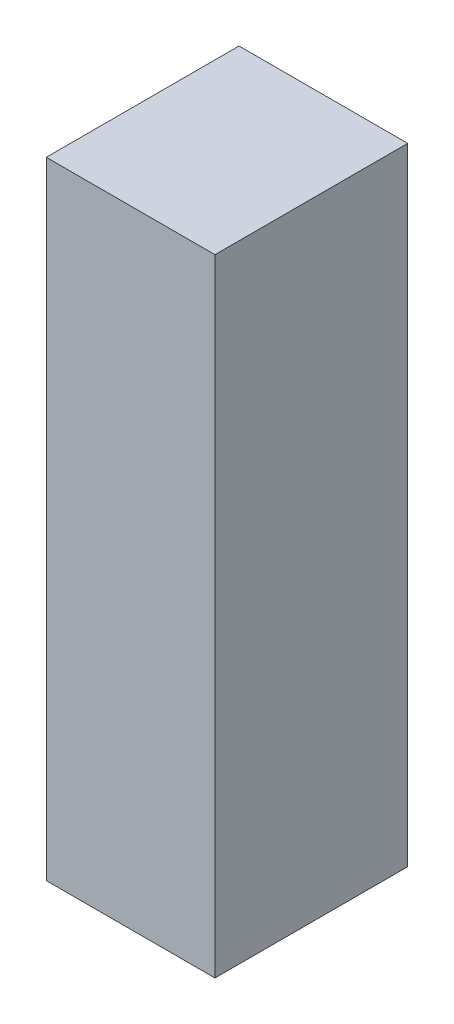
ISO-10303-21;
HEADER;
FILE_DESCRIPTION(('STEP AP214'),'2;1');
FILE_NAME('part.step','',(''),(''),'','','');
FILE_SCHEMA(('AUTOMOTIVE_DESIGN { 1 0 10303 214 1 1 1 1 }'));
ENDSEC;
DATA;
#1=APPLICATION_CONTEXT('core data for automotive mechanical design processes');
#2=APPLICATION_PROTOCOL_DEFINITION('international standard','automotive_design',2000,#1);
#3=PRODUCT_CONTEXT('',#1,'mechanical');
#4=PRODUCT('Part','Part','',(#3));
#5=PRODUCT_RELATED_PRODUCT_CATEGORY('part','',(#4));
#6=PRODUCT_DEFINITION_FORMATION('','',#4);
#7=PRODUCT_DEFINITION_CONTEXT('part definition',#1,'design');
#8=PRODUCT_DEFINITION('design','',#6,#7);
#9=PRODUCT_DEFINITION_SHAPE('','',#8);
#10=(LENGTH_UNIT() NAMED_UNIT(*) SI_UNIT(.MILLI.,.METRE.));
#11=(NAMED_UNIT(*) PLANE_ANGLE_UNIT() SI_UNIT($,.RADIAN.));
#12=(NAMED_UNIT(*) SI_UNIT($,.STERADIAN.) SOLID_ANGLE_UNIT());
#13=UNCERTAINTY_MEASURE_WITH_UNIT(LENGTH_MEASURE(1.E-05),#10,'distance_accuracy_value','');
#14=(GEOMETRIC_REPRESENTATION_CONTEXT(3) GLOBAL_UNCERTAINTY_ASSIGNED_CONTEXT((#13)) GLOBAL_UNIT_ASSIGNED_CONTEXT((#10,
#11,#12)) REPRESENTATION_CONTEXT('',''));
#15=CARTESIAN_POINT('',(0.,0.,0.));
#16=DIRECTION('',(0.,0.,1.));
#17=DIRECTION('',(1.,0.,0.));
#18=AXIS2_PLACEMENT_3D('',#15,#16,#17);
#19=CARTESIAN_POINT('',(-0.17499838,-0.6499987,0.));
#20=DIRECTION('',(-1.,0.,0.));
#21=DIRECTION('',(0.,0.,1.));
#22=AXIS2_PLACEMENT_3D('',#19,#20,#21);
#23=PLANE('',#22);
#24=DIRECTION('',(0.,0.,1.));
#25=VECTOR('',#24,1.);
#26=CARTESIAN_POINT('',(-0.17499838,0.65000124,0.));
#27=LINE('',#26,#25);
#28=CARTESIAN_POINT('',(-0.17499838,0.65000124,0.));
#29=VERTEX_POINT('',#28);
#30=CARTESIAN_POINT('',(-0.17499838,0.65000124,0.4));
#31=VERTEX_POINT('',#30);
#32=EDGE_CURVE('E19',#29,#31,#27,.T.);
#33=ORIENTED_EDGE('',*,*,#32,.F.);
#34=DIRECTION('',(0.,1.,0.));
#35=VECTOR('',#34,1.);
#36=CARTESIAN_POINT('',(-0.17499838,0.65000124,0.));
#37=LINE('',#36,#35);
#38=CARTESIAN_POINT('',(-0.17499838,-0.6499987,0.));
#39=VERTEX_POINT('',#38);
#40=EDGE_CURVE('E86',#29,#39,#37,.F.);
#41=ORIENTED_EDGE('',*,*,#40,.T.);
#42=DIRECTION('',(0.,0.,-1.));
#43=VECTOR('',#42,1.);
#44=CARTESIAN_POINT('',(-0.17499838,-0.6499987,0.));
#45=LINE('',#44,#43);
#46=CARTESIAN_POINT('',(-0.17499838,-0.6499987,0.4));
#47=VERTEX_POINT('',#46);
#48=EDGE_CURVE('E61',#47,#39,#45,.T.);
#49=ORIENTED_EDGE('',*,*,#48,.F.);
#50=DIRECTION('',(0.,1.,0.));
#51=VECTOR('',#50,1.);
#52=CARTESIAN_POINT('',(-0.17499838,0.65000124,0.4));
#53=LINE('',#52,#51);
#54=EDGE_CURVE('E56',#31,#47,#53,.F.);
#55=ORIENTED_EDGE('',*,*,#54,.F.);
#56=EDGE_LOOP('',(#33,#41,#49,#55));
#57=FACE_BOUND('',#56,.T.);
#58=ADVANCED_FACE('F16',(#57),#23,.T.);
#59=CARTESIAN_POINT('',(-0.17499838,0.65000124,0.));
#60=DIRECTION('',(0.,1.,0.));
#61=DIRECTION('',(0.,0.,1.));
#62=AXIS2_PLACEMENT_3D('',#59,#60,#61);
#63=PLANE('',#62);
#64=DIRECTION('',(0.,0.,-1.));
#65=VECTOR('',#64,1.);
#66=CARTESIAN_POINT('',(0.17500092,0.65000124,0.));
#67=LINE('',#66,#65);
#68=CARTESIAN_POINT('',(0.17500092,0.65000124,0.));
#69=VERTEX_POINT('',#68);
#70=CARTESIAN_POINT('',(0.17500092,0.65000124,0.4));
#71=VERTEX_POINT('',#70);
#72=EDGE_CURVE('E93',#69,#71,#67,.F.);
#73=ORIENTED_EDGE('',*,*,#72,.F.);
#74=DIRECTION('',(1.,0.,0.));
#75=VECTOR('',#74,1.);
#76=CARTESIAN_POINT('',(-0.17499838,0.65000124,0.));
#77=LINE('',#76,#75);
#78=EDGE_CURVE('E69',#69,#29,#77,.F.);
#79=ORIENTED_EDGE('',*,*,#78,.T.);
#80=ORIENTED_EDGE('',*,*,#32,.T.);
#81=DIRECTION('',(1.,0.,0.));
#82=VECTOR('',#81,1.);
#83=CARTESIAN_POINT('',(-0.17499838,0.65000124,0.4));
#84=LINE('',#83,#82);
#85=EDGE_CURVE('E64',#71,#31,#84,.F.);
#86=ORIENTED_EDGE('',*,*,#85,.F.);
#87=EDGE_LOOP('',(#73,#79,#80,#86));
#88=FACE_BOUND('',#87,.T.);
#89=ADVANCED_FACE('F66',(#88),#63,.T.);
#90=CARTESIAN_POINT('',(-0.17499838,0.65000124,0.4));
#91=DIRECTION('',(0.,0.,1.));
#92=DIRECTION('',(1.,0.,0.));
#93=AXIS2_PLACEMENT_3D('',#90,#91,#92);
#94=PLANE('',#93);
#95=DIRECTION('',(0.,1.,0.));
#96=VECTOR('',#95,1.);
#97=CARTESIAN_POINT('',(0.17500092,0.65000124,0.4));
#98=LINE('',#97,#96);
#99=CARTESIAN_POINT('',(0.17500092,-0.6499987,0.4));
#100=VERTEX_POINT('',#99);
#101=EDGE_CURVE('E74',#71,#100,#98,.F.);
#102=ORIENTED_EDGE('',*,*,#101,.F.);
#103=ORIENTED_EDGE('',*,*,#85,.T.);
#104=ORIENTED_EDGE('',*,*,#54,.T.);
#105=DIRECTION('',(1.,0.,0.));
#106=VECTOR('',#105,1.);
#107=CARTESIAN_POINT('',(0.17500092,-0.6499987,0.4));
#108=LINE('',#107,#106);
#109=EDGE_CURVE('E77',#100,#47,#108,.F.);
#110=ORIENTED_EDGE('',*,*,#109,.F.);
#111=EDGE_LOOP('',(#102,#103,#104,#110));
#112=FACE_BOUND('',#111,.T.);
#113=ADVANCED_FACE('F72',(#112),#94,.T.);
#114=CARTESIAN_POINT('',(0.17500092,-0.6499987,0.));
#115=DIRECTION('',(0.,-1.,0.));
#116=DIRECTION('',(0.,0.,-1.));
#117=AXIS2_PLACEMENT_3D('',#114,#115,#116);
#118=PLANE('',#117);
#119=ORIENTED_EDGE('',*,*,#48,.T.);
#120=DIRECTION('',(1.,0.,0.));
#121=VECTOR('',#120,1.);
#122=CARTESIAN_POINT('',(-0.17499838,-0.6499987,0.));
#123=LINE('',#122,#121);
#124=CARTESIAN_POINT('',(0.17500092,-0.6499987,0.));
#125=VERTEX_POINT('',#124);
#126=EDGE_CURVE('E35',#39,#125,#123,.T.);
#127=ORIENTED_EDGE('',*,*,#126,.T.);
#128=DIRECTION('',(0.,0.,-1.));
#129=VECTOR('',#128,1.);
#130=CARTESIAN_POINT('',(0.17500092,-0.6499987,0.));
#131=LINE('',#130,#129);
#132=EDGE_CURVE('E26',#100,#125,#131,.T.);
#133=ORIENTED_EDGE('',*,*,#132,.F.);
#134=ORIENTED_EDGE('',*,*,#109,.T.);
#135=EDGE_LOOP('',(#119,#127,#133,#134));
#136=FACE_BOUND('',#135,.T.);
#137=ADVANCED_FACE('F103',(#136),#118,.T.);
#138=CARTESIAN_POINT('',(-0.17499838,0.65000124,0.));
#139=DIRECTION('',(0.,0.,1.));
#140=DIRECTION('',(1.,0.,0.));
#141=AXIS2_PLACEMENT_3D('',#138,#139,#140);
#142=PLANE('',#141);
#143=DIRECTION('',(0.,1.,0.));
#144=VECTOR('',#143,1.);
#145=CARTESIAN_POINT('',(0.17500092,0.65000124,0.));
#146=LINE('',#145,#144);
#147=EDGE_CURVE('E11',#125,#69,#146,.T.);
#148=ORIENTED_EDGE('',*,*,#147,.F.);
#149=ORIENTED_EDGE('',*,*,#126,.F.);
#150=ORIENTED_EDGE('',*,*,#40,.F.);
#151=ORIENTED_EDGE('',*,*,#78,.F.);
#152=EDGE_LOOP('',(#148,#149,#150,#151));
#153=FACE_BOUND('',#152,.T.);
#154=ADVANCED_FACE('F105',(#153),#142,.F.);
#155=CARTESIAN_POINT('',(0.17500092,0.65000124,0.));
#156=DIRECTION('',(1.,0.,0.));
#157=DIRECTION('',(0.,0.,-1.));
#158=AXIS2_PLACEMENT_3D('',#155,#156,#157);
#159=PLANE('',#158);
#160=ORIENTED_EDGE('',*,*,#132,.T.);
#161=ORIENTED_EDGE('',*,*,#147,.T.);
#162=ORIENTED_EDGE('',*,*,#72,.T.);
#163=ORIENTED_EDGE('',*,*,#101,.T.);
#164=EDGE_LOOP('',(#160,#161,#162,#163));
#165=FACE_BOUND('',#164,.T.);
#166=ADVANCED_FACE('F102',(#165),#159,.T.);
#167=CLOSED_SHELL('',(#58,#89,#113,#137,#154,#166));
#168=MANIFOLD_SOLID_BREP('B1',#167);
#169=ADVANCED_BREP_SHAPE_REPRESENTATION('',(#18,#168),#14);
#170=SHAPE_DEFINITION_REPRESENTATION(#9,#169);
ENDSEC;
END-ISO-10303-21;
